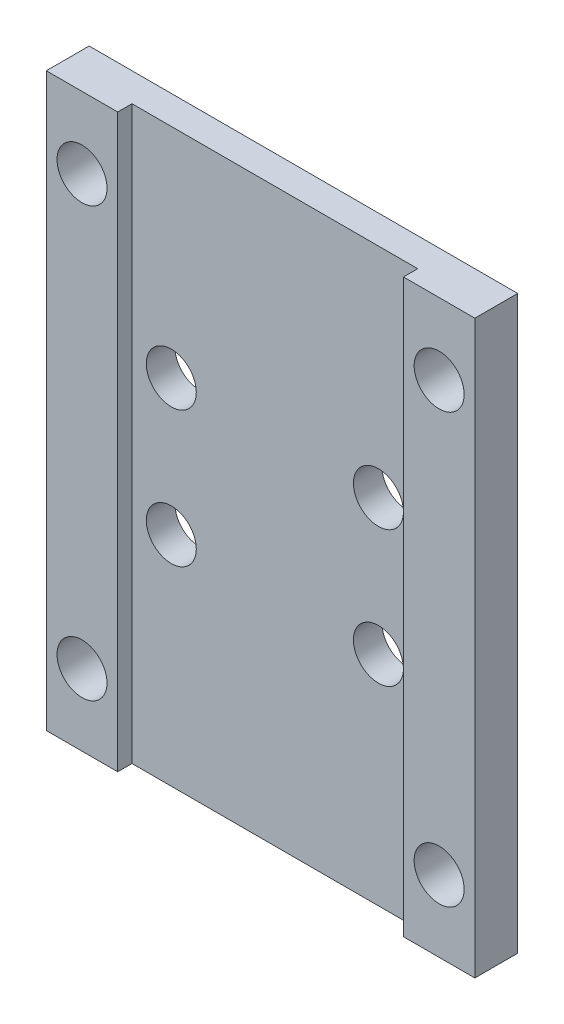
ISO-10303-21;
HEADER;
FILE_DESCRIPTION(('STEP AP214'),'2;1');
FILE_NAME('part.step','',(''),(''),'','','');
FILE_SCHEMA(('AUTOMOTIVE_DESIGN { 1 0 10303 214 1 1 1 1 }'));
ENDSEC;
DATA;
#1=APPLICATION_CONTEXT('core data for automotive mechanical design processes');
#2=APPLICATION_PROTOCOL_DEFINITION('international standard','automotive_design',2000,#1);
#3=PRODUCT_CONTEXT('',#1,'mechanical');
#4=PRODUCT('Part','Part','',(#3));
#5=PRODUCT_RELATED_PRODUCT_CATEGORY('part','',(#4));
#6=PRODUCT_DEFINITION_FORMATION('','',#4);
#7=PRODUCT_DEFINITION_CONTEXT('part definition',#1,'design');
#8=PRODUCT_DEFINITION('design','',#6,#7);
#9=PRODUCT_DEFINITION_SHAPE('','',#8);
#10=(LENGTH_UNIT() NAMED_UNIT(*) SI_UNIT(.MILLI.,.METRE.));
#11=(NAMED_UNIT(*) PLANE_ANGLE_UNIT() SI_UNIT($,.RADIAN.));
#12=(NAMED_UNIT(*) SI_UNIT($,.STERADIAN.) SOLID_ANGLE_UNIT());
#13=UNCERTAINTY_MEASURE_WITH_UNIT(LENGTH_MEASURE(1.E-05),#10,'distance_accuracy_value','');
#14=(GEOMETRIC_REPRESENTATION_CONTEXT(3) GLOBAL_UNCERTAINTY_ASSIGNED_CONTEXT((#13)) GLOBAL_UNIT_ASSIGNED_CONTEXT((#10,
#11,#12)) REPRESENTATION_CONTEXT('',''));
#15=CARTESIAN_POINT('',(0.,0.,0.));
#16=DIRECTION('',(0.,0.,1.));
#17=DIRECTION('',(1.,0.,0.));
#18=AXIS2_PLACEMENT_3D('',#15,#16,#17);
#19=CARTESIAN_POINT('',(0.,0.,0.));
#20=DIRECTION('',(0.,0.,1.));
#21=DIRECTION('',(1.,0.,0.));
#22=AXIS2_PLACEMENT_3D('',#19,#20,#21);
#23=PLANE('',#22);
#24=DIRECTION('',(0.,1.,0.));
#25=VECTOR('',#24,1.);
#26=CARTESIAN_POINT('',(9.99999999999999,0.,0.));
#27=LINE('',#26,#25);
#28=CARTESIAN_POINT('',(9.99999999999999,-20.,0.));
#29=VERTEX_POINT('',#28);
#30=CARTESIAN_POINT('',(9.99999999999999,20.,0.));
#31=VERTEX_POINT('',#30);
#32=EDGE_CURVE('E54',#29,#31,#27,.T.);
#33=ORIENTED_EDGE('',*,*,#32,.T.);
#34=DIRECTION('',(1.,0.,0.));
#35=VECTOR('',#34,1.);
#36=CARTESIAN_POINT('',(0.,20.,0.));
#37=LINE('',#36,#35);
#38=CARTESIAN_POINT('',(-9.99999999999999,20.,0.));
#39=VERTEX_POINT('',#38);
#40=EDGE_CURVE('E197',#39,#31,#37,.T.);
#41=ORIENTED_EDGE('',*,*,#40,.F.);
#42=DIRECTION('',(0.,-1.,0.));
#43=VECTOR('',#42,1.);
#44=CARTESIAN_POINT('',(-9.99999999999999,0.,0.));
#45=LINE('',#44,#43);
#46=CARTESIAN_POINT('',(-9.99999999999999,-20.,0.));
#47=VERTEX_POINT('',#46);
#48=EDGE_CURVE('E111',#39,#47,#45,.T.);
#49=ORIENTED_EDGE('',*,*,#48,.T.);
#50=DIRECTION('',(1.,0.,0.));
#51=VECTOR('',#50,1.);
#52=CARTESIAN_POINT('',(0.,-20.,0.));
#53=LINE('',#52,#51);
#54=EDGE_CURVE('E59',#47,#29,#53,.T.);
#55=ORIENTED_EDGE('',*,*,#54,.T.);
#56=EDGE_LOOP('',(#33,#41,#49,#55));
#57=FACE_BOUND('',#56,.T.);
#58=CARTESIAN_POINT('',(-7.25,4.75,0.));
#59=DIRECTION('',(0.,0.,1.));
#60=DIRECTION('',(1.,0.,0.));
#61=AXIS2_PLACEMENT_3D('',#58,#59,#60);
#62=CIRCLE('',#61,1.75);
#63=CARTESIAN_POINT('',(-5.5,4.75,0.));
#64=VERTEX_POINT('',#63);
#65=EDGE_CURVE('E165',#64,#64,#62,.T.);
#66=ORIENTED_EDGE('',*,*,#65,.F.);
#67=EDGE_LOOP('',(#66));
#68=FACE_BOUND('',#67,.T.);
#69=CARTESIAN_POINT('',(7.25,4.75,0.));
#70=DIRECTION('',(0.,0.,1.));
#71=DIRECTION('',(1.,0.,0.));
#72=AXIS2_PLACEMENT_3D('',#69,#70,#71);
#73=CIRCLE('',#72,1.75);
#74=CARTESIAN_POINT('',(9.,4.75,0.));
#75=VERTEX_POINT('',#74);
#76=EDGE_CURVE('E205',#75,#75,#73,.T.);
#77=ORIENTED_EDGE('',*,*,#76,.F.);
#78=EDGE_LOOP('',(#77));
#79=FACE_BOUND('',#78,.T.);
#80=CARTESIAN_POINT('',(7.25,-4.75,0.));
#81=DIRECTION('',(0.,0.,1.));
#82=DIRECTION('',(1.,0.,0.));
#83=AXIS2_PLACEMENT_3D('',#80,#81,#82);
#84=CIRCLE('',#83,1.75);
#85=CARTESIAN_POINT('',(9.,-4.75,0.));
#86=VERTEX_POINT('',#85);
#87=EDGE_CURVE('E202',#86,#86,#84,.T.);
#88=ORIENTED_EDGE('',*,*,#87,.F.);
#89=EDGE_LOOP('',(#88));
#90=FACE_BOUND('',#89,.T.);
#91=CARTESIAN_POINT('',(-7.25,-4.75,0.));
#92=DIRECTION('',(0.,0.,1.));
#93=DIRECTION('',(1.,0.,0.));
#94=AXIS2_PLACEMENT_3D('',#91,#92,#93);
#95=CIRCLE('',#94,1.75);
#96=CARTESIAN_POINT('',(-5.5,-4.75,0.));
#97=VERTEX_POINT('',#96);
#98=EDGE_CURVE('E199',#97,#97,#95,.T.);
#99=ORIENTED_EDGE('',*,*,#98,.F.);
#100=EDGE_LOOP('',(#99));
#101=FACE_BOUND('',#100,.T.);
#102=ADVANCED_FACE('F37',(#57,#68,#79,#90,#101),#23,.T.);
#103=CARTESIAN_POINT('',(-15.,0.,-2.));
#104=DIRECTION('',(-1.,0.,0.));
#105=DIRECTION('',(0.,-1.,0.));
#106=AXIS2_PLACEMENT_3D('',#103,#104,#105);
#107=PLANE('',#106);
#108=DIRECTION('',(0.,0.,1.));
#109=VECTOR('',#108,1.);
#110=CARTESIAN_POINT('',(-15.,-20.,-2.));
#111=LINE('',#110,#109);
#112=CARTESIAN_POINT('',(-15.,-20.,-2.));
#113=VERTEX_POINT('',#112);
#114=CARTESIAN_POINT('',(-15.,-20.,1.));
#115=VERTEX_POINT('',#114);
#116=EDGE_CURVE('E41',#113,#115,#111,.T.);
#117=ORIENTED_EDGE('',*,*,#116,.T.);
#118=DIRECTION('',(0.,-1.,0.));
#119=VECTOR('',#118,1.);
#120=CARTESIAN_POINT('',(-15.,0.,1.));
#121=LINE('',#120,#119);
#122=CARTESIAN_POINT('',(-15.,20.,1.));
#123=VERTEX_POINT('',#122);
#124=EDGE_CURVE('E145',#123,#115,#121,.T.);
#125=ORIENTED_EDGE('',*,*,#124,.F.);
#126=DIRECTION('',(0.,0.,1.));
#127=VECTOR('',#126,1.);
#128=CARTESIAN_POINT('',(-15.,20.,-2.));
#129=LINE('',#128,#127);
#130=CARTESIAN_POINT('',(-15.,20.,-2.));
#131=VERTEX_POINT('',#130);
#132=EDGE_CURVE('E11',#131,#123,#129,.T.);
#133=ORIENTED_EDGE('',*,*,#132,.F.);
#134=DIRECTION('',(0.,-1.,0.));
#135=VECTOR('',#134,1.);
#136=CARTESIAN_POINT('',(-15.,0.,-2.));
#137=LINE('',#136,#135);
#138=EDGE_CURVE('E168',#131,#113,#137,.T.);
#139=ORIENTED_EDGE('',*,*,#138,.T.);
#140=EDGE_LOOP('',(#117,#125,#133,#139));
#141=FACE_BOUND('',#140,.T.);
#142=ADVANCED_FACE('F213',(#141),#107,.T.);
#143=CARTESIAN_POINT('',(0.,20.,-2.));
#144=DIRECTION('',(0.,-1.,0.));
#145=DIRECTION('',(0.,0.,-1.));
#146=AXIS2_PLACEMENT_3D('',#143,#144,#145);
#147=PLANE('',#146);
#148=ORIENTED_EDGE('',*,*,#132,.T.);
#149=DIRECTION('',(1.,0.,0.));
#150=VECTOR('',#149,1.);
#151=CARTESIAN_POINT('',(0.,20.,1.));
#152=LINE('',#151,#150);
#153=CARTESIAN_POINT('',(-9.99999999999999,20.,1.));
#154=VERTEX_POINT('',#153);
#155=EDGE_CURVE('E153',#123,#154,#152,.T.);
#156=ORIENTED_EDGE('',*,*,#155,.T.);
#157=DIRECTION('',(0.,0.,-1.));
#158=VECTOR('',#157,1.);
#159=CARTESIAN_POINT('',(-9.99999999999999,20.,1.));
#160=LINE('',#159,#158);
#161=EDGE_CURVE('E156',#154,#39,#160,.T.);
#162=ORIENTED_EDGE('',*,*,#161,.T.);
#163=ORIENTED_EDGE('',*,*,#40,.T.);
#164=DIRECTION('',(0.,0.,-1.));
#165=VECTOR('',#164,1.);
#166=CARTESIAN_POINT('',(9.99999999999999,20.,1.));
#167=LINE('',#166,#165);
#168=CARTESIAN_POINT('',(9.99999999999999,20.,1.));
#169=VERTEX_POINT('',#168);
#170=EDGE_CURVE('E112',#169,#31,#167,.T.);
#171=ORIENTED_EDGE('',*,*,#170,.F.);
#172=DIRECTION('',(1.,0.,0.));
#173=VECTOR('',#172,1.);
#174=CARTESIAN_POINT('',(0.,20.,1.));
#175=LINE('',#174,#173);
#176=CARTESIAN_POINT('',(15.,20.,1.));
#177=VERTEX_POINT('',#176);
#178=EDGE_CURVE('E127',#169,#177,#175,.T.);
#179=ORIENTED_EDGE('',*,*,#178,.T.);
#180=DIRECTION('',(0.,0.,1.));
#181=VECTOR('',#180,1.);
#182=CARTESIAN_POINT('',(15.,20.,-2.));
#183=LINE('',#182,#181);
#184=CARTESIAN_POINT('',(15.,20.,-2.));
#185=VERTEX_POINT('',#184);
#186=EDGE_CURVE('E46',#185,#177,#183,.T.);
#187=ORIENTED_EDGE('',*,*,#186,.F.);
#188=DIRECTION('',(1.,0.,0.));
#189=VECTOR('',#188,1.);
#190=CARTESIAN_POINT('',(0.,20.,-2.));
#191=LINE('',#190,#189);
#192=EDGE_CURVE('E175',#131,#185,#191,.T.);
#193=ORIENTED_EDGE('',*,*,#192,.F.);
#194=EDGE_LOOP('',(#148,#156,#162,#163,#171,#179,#187,#193));
#195=FACE_BOUND('',#194,.T.);
#196=ADVANCED_FACE('F222',(#195),#147,.F.);
#197=CARTESIAN_POINT('',(15.,0.,-2.));
#198=DIRECTION('',(-1.,0.,0.));
#199=DIRECTION('',(0.,0.,1.));
#200=AXIS2_PLACEMENT_3D('',#197,#198,#199);
#201=PLANE('',#200);
#202=ORIENTED_EDGE('',*,*,#186,.T.);
#203=DIRECTION('',(0.,-1.,0.));
#204=VECTOR('',#203,1.);
#205=CARTESIAN_POINT('',(15.,0.,1.));
#206=LINE('',#205,#204);
#207=CARTESIAN_POINT('',(15.,-20.,1.));
#208=VERTEX_POINT('',#207);
#209=EDGE_CURVE('E123',#177,#208,#206,.T.);
#210=ORIENTED_EDGE('',*,*,#209,.T.);
#211=DIRECTION('',(0.,0.,1.));
#212=VECTOR('',#211,1.);
#213=CARTESIAN_POINT('',(15.,-20.,-2.));
#214=LINE('',#213,#212);
#215=CARTESIAN_POINT('',(15.,-20.,-2.));
#216=VERTEX_POINT('',#215);
#217=EDGE_CURVE('E119',#216,#208,#214,.T.);
#218=ORIENTED_EDGE('',*,*,#217,.F.);
#219=DIRECTION('',(0.,-1.,0.));
#220=VECTOR('',#219,1.);
#221=CARTESIAN_POINT('',(15.,0.,-2.));
#222=LINE('',#221,#220);
#223=EDGE_CURVE('E173',#185,#216,#222,.T.);
#224=ORIENTED_EDGE('',*,*,#223,.F.);
#225=EDGE_LOOP('',(#202,#210,#218,#224));
#226=FACE_BOUND('',#225,.T.);
#227=ADVANCED_FACE('F230',(#226),#201,.F.);
#228=CARTESIAN_POINT('',(12.5,-15.,-2.));
#229=DIRECTION('',(0.,0.,1.));
#230=DIRECTION('',(1.,0.,0.));
#231=AXIS2_PLACEMENT_3D('',#228,#229,#230);
#232=CYLINDRICAL_SURFACE('',#231,1.75);
#233=CARTESIAN_POINT('',(12.5,-15.,-2.));
#234=DIRECTION('',(0.,0.,1.));
#235=DIRECTION('',(1.,0.,0.));
#236=AXIS2_PLACEMENT_3D('',#233,#234,#235);
#237=CIRCLE('',#236,1.75);
#238=CARTESIAN_POINT('',(14.25,-15.,-2.));
#239=VERTEX_POINT('',#238);
#240=EDGE_CURVE('E190',#239,#239,#237,.T.);
#241=ORIENTED_EDGE('',*,*,#240,.F.);
#242=EDGE_LOOP('',(#241));
#243=FACE_BOUND('',#242,.T.);
#244=CARTESIAN_POINT('',(12.5,-15.,1.));
#245=DIRECTION('',(0.,0.,1.));
#246=DIRECTION('',(1.,0.,0.));
#247=AXIS2_PLACEMENT_3D('',#244,#245,#246);
#248=CIRCLE('',#247,1.75);
#249=CARTESIAN_POINT('',(14.25,-15.,1.));
#250=VERTEX_POINT('',#249);
#251=EDGE_CURVE('E131',#250,#250,#248,.T.);
#252=ORIENTED_EDGE('',*,*,#251,.T.);
#253=EDGE_LOOP('',(#252));
#254=FACE_BOUND('',#253,.T.);
#255=ADVANCED_FACE('F255',(#243,#254),#232,.F.);
#256=CARTESIAN_POINT('',(-7.25,4.75,-2.));
#257=DIRECTION('',(0.,0.,1.));
#258=DIRECTION('',(1.,0.,0.));
#259=AXIS2_PLACEMENT_3D('',#256,#257,#258);
#260=CYLINDRICAL_SURFACE('',#259,1.75);
#261=CARTESIAN_POINT('',(-7.25,4.75,-2.));
#262=DIRECTION('',(0.,0.,1.));
#263=DIRECTION('',(1.,0.,0.));
#264=AXIS2_PLACEMENT_3D('',#261,#262,#263);
#265=CIRCLE('',#264,1.75);
#266=CARTESIAN_POINT('',(-5.5,4.75,-2.));
#267=VERTEX_POINT('',#266);
#268=EDGE_CURVE('E187',#267,#267,#265,.T.);
#269=ORIENTED_EDGE('',*,*,#268,.F.);
#270=EDGE_LOOP('',(#269));
#271=FACE_BOUND('',#270,.T.);
#272=ORIENTED_EDGE('',*,*,#65,.T.);
#273=EDGE_LOOP('',(#272));
#274=FACE_BOUND('',#273,.T.);
#275=ADVANCED_FACE('F258',(#271,#274),#260,.F.);
#276=CARTESIAN_POINT('',(7.25,4.75,-2.));
#277=DIRECTION('',(0.,0.,1.));
#278=DIRECTION('',(1.,0.,0.));
#279=AXIS2_PLACEMENT_3D('',#276,#277,#278);
#280=CYLINDRICAL_SURFACE('',#279,1.75);
#281=CARTESIAN_POINT('',(7.25,4.75,-2.));
#282=DIRECTION('',(0.,0.,1.));
#283=DIRECTION('',(1.,0.,0.));
#284=AXIS2_PLACEMENT_3D('',#281,#282,#283);
#285=CIRCLE('',#284,1.75);
#286=CARTESIAN_POINT('',(9.,4.75,-2.));
#287=VERTEX_POINT('',#286);
#288=EDGE_CURVE('E184',#287,#287,#285,.T.);
#289=ORIENTED_EDGE('',*,*,#288,.F.);
#290=EDGE_LOOP('',(#289));
#291=FACE_BOUND('',#290,.T.);
#292=ORIENTED_EDGE('',*,*,#76,.T.);
#293=EDGE_LOOP('',(#292));
#294=FACE_BOUND('',#293,.T.);
#295=ADVANCED_FACE('F262',(#291,#294),#280,.F.);
#296=CARTESIAN_POINT('',(7.25,-4.75,-2.));
#297=DIRECTION('',(0.,0.,1.));
#298=DIRECTION('',(1.,0.,0.));
#299=AXIS2_PLACEMENT_3D('',#296,#297,#298);
#300=CYLINDRICAL_SURFACE('',#299,1.75);
#301=CARTESIAN_POINT('',(7.25,-4.75,-2.));
#302=DIRECTION('',(0.,0.,1.));
#303=DIRECTION('',(1.,0.,0.));
#304=AXIS2_PLACEMENT_3D('',#301,#302,#303);
#305=CIRCLE('',#304,1.75);
#306=CARTESIAN_POINT('',(9.,-4.75,-2.));
#307=VERTEX_POINT('',#306);
#308=EDGE_CURVE('E181',#307,#307,#305,.T.);
#309=ORIENTED_EDGE('',*,*,#308,.F.);
#310=EDGE_LOOP('',(#309));
#311=FACE_BOUND('',#310,.T.);
#312=ORIENTED_EDGE('',*,*,#87,.T.);
#313=EDGE_LOOP('',(#312));
#314=FACE_BOUND('',#313,.T.);
#315=ADVANCED_FACE('F266',(#311,#314),#300,.F.);
#316=CARTESIAN_POINT('',(-7.25,-4.75,-2.));
#317=DIRECTION('',(0.,0.,1.));
#318=DIRECTION('',(1.,0.,0.));
#319=AXIS2_PLACEMENT_3D('',#316,#317,#318);
#320=CYLINDRICAL_SURFACE('',#319,1.75);
#321=CARTESIAN_POINT('',(-7.25,-4.75,-2.));
#322=DIRECTION('',(0.,0.,1.));
#323=DIRECTION('',(1.,0.,0.));
#324=AXIS2_PLACEMENT_3D('',#321,#322,#323);
#325=CIRCLE('',#324,1.75);
#326=CARTESIAN_POINT('',(-5.5,-4.75,-2.));
#327=VERTEX_POINT('',#326);
#328=EDGE_CURVE('E178',#327,#327,#325,.T.);
#329=ORIENTED_EDGE('',*,*,#328,.F.);
#330=EDGE_LOOP('',(#329));
#331=FACE_BOUND('',#330,.T.);
#332=ORIENTED_EDGE('',*,*,#98,.T.);
#333=EDGE_LOOP('',(#332));
#334=FACE_BOUND('',#333,.T.);
#335=ADVANCED_FACE('F270',(#331,#334),#320,.F.);
#336=CARTESIAN_POINT('',(0.,-20.,-2.));
#337=DIRECTION('',(0.,-1.,0.));
#338=DIRECTION('',(0.,0.,-1.));
#339=AXIS2_PLACEMENT_3D('',#336,#337,#338);
#340=PLANE('',#339);
#341=ORIENTED_EDGE('',*,*,#54,.F.);
#342=DIRECTION('',(0.,0.,-1.));
#343=VECTOR('',#342,1.);
#344=CARTESIAN_POINT('',(-9.99999999999999,-20.,1.));
#345=LINE('',#344,#343);
#346=CARTESIAN_POINT('',(-9.99999999999999,-20.,1.));
#347=VERTEX_POINT('',#346);
#348=EDGE_CURVE('E159',#347,#47,#345,.T.);
#349=ORIENTED_EDGE('',*,*,#348,.F.);
#350=DIRECTION('',(1.,0.,0.));
#351=VECTOR('',#350,1.);
#352=CARTESIAN_POINT('',(0.,-20.,1.));
#353=LINE('',#352,#351);
#354=EDGE_CURVE('E148',#115,#347,#353,.T.);
#355=ORIENTED_EDGE('',*,*,#354,.F.);
#356=ORIENTED_EDGE('',*,*,#116,.F.);
#357=DIRECTION('',(1.,0.,0.));
#358=VECTOR('',#357,1.);
#359=CARTESIAN_POINT('',(0.,-20.,-2.));
#360=LINE('',#359,#358);
#361=EDGE_CURVE('E171',#113,#216,#360,.T.);
#362=ORIENTED_EDGE('',*,*,#361,.T.);
#363=ORIENTED_EDGE('',*,*,#217,.T.);
#364=DIRECTION('',(1.,0.,0.));
#365=VECTOR('',#364,1.);
#366=CARTESIAN_POINT('',(0.,-20.,1.));
#367=LINE('',#366,#365);
#368=CARTESIAN_POINT('',(9.99999999999999,-20.,1.));
#369=VERTEX_POINT('',#368);
#370=EDGE_CURVE('E115',#369,#208,#367,.T.);
#371=ORIENTED_EDGE('',*,*,#370,.F.);
#372=DIRECTION('',(0.,0.,-1.));
#373=VECTOR('',#372,1.);
#374=CARTESIAN_POINT('',(9.99999999999999,-20.,1.));
#375=LINE('',#374,#373);
#376=EDGE_CURVE('E103',#369,#29,#375,.T.);
#377=ORIENTED_EDGE('',*,*,#376,.T.);
#378=EDGE_LOOP('',(#341,#349,#355,#356,#362,#363,#371,#377));
#379=FACE_BOUND('',#378,.T.);
#380=ADVANCED_FACE('F116',(#379),#340,.T.);
#381=CARTESIAN_POINT('',(-12.5,15.,-2.));
#382=DIRECTION('',(0.,0.,1.));
#383=DIRECTION('',(1.,0.,0.));
#384=AXIS2_PLACEMENT_3D('',#381,#382,#383);
#385=CYLINDRICAL_SURFACE('',#384,1.75);
#386=CARTESIAN_POINT('',(-12.5,15.,-2.));
#387=DIRECTION('',(0.,0.,1.));
#388=DIRECTION('',(1.,0.,0.));
#389=AXIS2_PLACEMENT_3D('',#386,#387,#388);
#390=CIRCLE('',#389,1.75);
#391=CARTESIAN_POINT('',(-10.75,15.,-2.));
#392=VERTEX_POINT('',#391);
#393=EDGE_CURVE('E164',#392,#392,#390,.T.);
#394=ORIENTED_EDGE('',*,*,#393,.F.);
#395=EDGE_LOOP('',(#394));
#396=FACE_BOUND('',#395,.T.);
#397=CARTESIAN_POINT('',(-12.5,15.,1.));
#398=DIRECTION('',(0.,0.,1.));
#399=DIRECTION('',(1.,0.,0.));
#400=AXIS2_PLACEMENT_3D('',#397,#398,#399);
#401=CIRCLE('',#400,1.75);
#402=CARTESIAN_POINT('',(-10.75,15.,1.));
#403=VERTEX_POINT('',#402);
#404=EDGE_CURVE('E142',#403,#403,#401,.T.);
#405=ORIENTED_EDGE('',*,*,#404,.T.);
#406=EDGE_LOOP('',(#405));
#407=FACE_BOUND('',#406,.T.);
#408=ADVANCED_FACE('F280',(#396,#407),#385,.F.);
#409=CARTESIAN_POINT('',(-12.5,-15.,-2.));
#410=DIRECTION('',(0.,0.,1.));
#411=DIRECTION('',(1.,0.,0.));
#412=AXIS2_PLACEMENT_3D('',#409,#410,#411);
#413=CYLINDRICAL_SURFACE('',#412,1.75);
#414=CARTESIAN_POINT('',(-12.5,-15.,-2.));
#415=DIRECTION('',(0.,0.,1.));
#416=DIRECTION('',(1.,0.,0.));
#417=AXIS2_PLACEMENT_3D('',#414,#415,#416);
#418=CIRCLE('',#417,1.75);
#419=CARTESIAN_POINT('',(-10.75,-15.,-2.));
#420=VERTEX_POINT('',#419);
#421=EDGE_CURVE('E161',#420,#420,#418,.T.);
#422=ORIENTED_EDGE('',*,*,#421,.F.);
#423=EDGE_LOOP('',(#422));
#424=FACE_BOUND('',#423,.T.);
#425=CARTESIAN_POINT('',(-12.5,-15.,1.));
#426=DIRECTION('',(0.,0.,1.));
#427=DIRECTION('',(1.,0.,0.));
#428=AXIS2_PLACEMENT_3D('',#425,#426,#427);
#429=CIRCLE('',#428,1.75);
#430=CARTESIAN_POINT('',(-10.75,-15.,1.));
#431=VERTEX_POINT('',#430);
#432=EDGE_CURVE('E139',#431,#431,#429,.T.);
#433=ORIENTED_EDGE('',*,*,#432,.T.);
#434=EDGE_LOOP('',(#433));
#435=FACE_BOUND('',#434,.T.);
#436=ADVANCED_FACE('F39',(#424,#435),#413,.F.);
#437=CARTESIAN_POINT('',(12.5,15.,-2.));
#438=DIRECTION('',(0.,0.,1.));
#439=DIRECTION('',(1.,0.,0.));
#440=AXIS2_PLACEMENT_3D('',#437,#438,#439);
#441=CYLINDRICAL_SURFACE('',#440,1.75);
#442=CARTESIAN_POINT('',(12.5,15.,-2.));
#443=DIRECTION('',(0.,0.,1.));
#444=DIRECTION('',(1.,0.,0.));
#445=AXIS2_PLACEMENT_3D('',#442,#443,#444);
#446=CIRCLE('',#445,1.75);
#447=CARTESIAN_POINT('',(14.25,15.,-2.));
#448=VERTEX_POINT('',#447);
#449=EDGE_CURVE('E193',#448,#448,#446,.T.);
#450=ORIENTED_EDGE('',*,*,#449,.F.);
#451=EDGE_LOOP('',(#450));
#452=FACE_BOUND('',#451,.T.);
#453=CARTESIAN_POINT('',(12.5,15.,1.));
#454=DIRECTION('',(0.,0.,1.));
#455=DIRECTION('',(1.,0.,0.));
#456=AXIS2_PLACEMENT_3D('',#453,#454,#455);
#457=CIRCLE('',#456,1.75);
#458=CARTESIAN_POINT('',(14.25,15.,1.));
#459=VERTEX_POINT('',#458);
#460=EDGE_CURVE('E128',#459,#459,#457,.T.);
#461=ORIENTED_EDGE('',*,*,#460,.T.);
#462=EDGE_LOOP('',(#461));
#463=FACE_BOUND('',#462,.T.);
#464=ADVANCED_FACE('F242',(#452,#463),#441,.F.);
#465=CARTESIAN_POINT('',(0.,0.,-2.));
#466=DIRECTION('',(0.,0.,1.));
#467=DIRECTION('',(1.,0.,0.));
#468=AXIS2_PLACEMENT_3D('',#465,#466,#467);
#469=PLANE('',#468);
#470=ORIENTED_EDGE('',*,*,#421,.T.);
#471=EDGE_LOOP('',(#470));
#472=FACE_BOUND('',#471,.T.);
#473=ORIENTED_EDGE('',*,*,#393,.T.);
#474=EDGE_LOOP('',(#473));
#475=FACE_BOUND('',#474,.T.);
#476=ORIENTED_EDGE('',*,*,#138,.F.);
#477=ORIENTED_EDGE('',*,*,#192,.T.);
#478=ORIENTED_EDGE('',*,*,#223,.T.);
#479=ORIENTED_EDGE('',*,*,#361,.F.);
#480=EDGE_LOOP('',(#476,#477,#478,#479));
#481=FACE_BOUND('',#480,.T.);
#482=ORIENTED_EDGE('',*,*,#328,.T.);
#483=EDGE_LOOP('',(#482));
#484=FACE_BOUND('',#483,.T.);
#485=ORIENTED_EDGE('',*,*,#308,.T.);
#486=EDGE_LOOP('',(#485));
#487=FACE_BOUND('',#486,.T.);
#488=ORIENTED_EDGE('',*,*,#288,.T.);
#489=EDGE_LOOP('',(#488));
#490=FACE_BOUND('',#489,.T.);
#491=ORIENTED_EDGE('',*,*,#268,.T.);
#492=EDGE_LOOP('',(#491));
#493=FACE_BOUND('',#492,.T.);
#494=ORIENTED_EDGE('',*,*,#240,.T.);
#495=EDGE_LOOP('',(#494));
#496=FACE_BOUND('',#495,.T.);
#497=ORIENTED_EDGE('',*,*,#449,.T.);
#498=EDGE_LOOP('',(#497));
#499=FACE_BOUND('',#498,.T.);
#500=ADVANCED_FACE('F227',(#472,#475,#481,#484,#487,#490,#493,#496,#499),#469,.F.);
#501=CARTESIAN_POINT('',(-9.99999999999999,0.,1.));
#502=DIRECTION('',(1.,0.,0.));
#503=DIRECTION('',(0.,0.,-1.));
#504=AXIS2_PLACEMENT_3D('',#501,#502,#503);
#505=PLANE('',#504);
#506=ORIENTED_EDGE('',*,*,#48,.F.);
#507=ORIENTED_EDGE('',*,*,#161,.F.);
#508=DIRECTION('',(0.,-1.,0.));
#509=VECTOR('',#508,1.);
#510=CARTESIAN_POINT('',(-9.99999999999999,0.,1.));
#511=LINE('',#510,#509);
#512=EDGE_CURVE('E150',#154,#347,#511,.T.);
#513=ORIENTED_EDGE('',*,*,#512,.T.);
#514=ORIENTED_EDGE('',*,*,#348,.T.);
#515=EDGE_LOOP('',(#506,#507,#513,#514));
#516=FACE_BOUND('',#515,.T.);
#517=ADVANCED_FACE('F233',(#516),#505,.T.);
#518=CARTESIAN_POINT('',(0.,0.,1.));
#519=DIRECTION('',(0.,0.,1.));
#520=DIRECTION('',(1.,0.,0.));
#521=AXIS2_PLACEMENT_3D('',#518,#519,#520);
#522=PLANE('',#521);
#523=ORIENTED_EDGE('',*,*,#432,.F.);
#524=EDGE_LOOP('',(#523));
#525=FACE_BOUND('',#524,.T.);
#526=ORIENTED_EDGE('',*,*,#404,.F.);
#527=EDGE_LOOP('',(#526));
#528=FACE_BOUND('',#527,.T.);
#529=ORIENTED_EDGE('',*,*,#124,.T.);
#530=ORIENTED_EDGE('',*,*,#354,.T.);
#531=ORIENTED_EDGE('',*,*,#512,.F.);
#532=ORIENTED_EDGE('',*,*,#155,.F.);
#533=EDGE_LOOP('',(#529,#530,#531,#532));
#534=FACE_BOUND('',#533,.T.);
#535=ADVANCED_FACE('F220',(#525,#528,#534),#522,.T.);
#536=CARTESIAN_POINT('',(9.99999999999999,0.,1.));
#537=DIRECTION('',(-1.,0.,0.));
#538=DIRECTION('',(0.,0.,1.));
#539=AXIS2_PLACEMENT_3D('',#536,#537,#538);
#540=PLANE('',#539);
#541=ORIENTED_EDGE('',*,*,#32,.F.);
#542=ORIENTED_EDGE('',*,*,#376,.F.);
#543=DIRECTION('',(0.,1.,0.));
#544=VECTOR('',#543,1.);
#545=CARTESIAN_POINT('',(9.99999999999999,0.,1.));
#546=LINE('',#545,#544);
#547=EDGE_CURVE('E108',#369,#169,#546,.T.);
#548=ORIENTED_EDGE('',*,*,#547,.T.);
#549=ORIENTED_EDGE('',*,*,#170,.T.);
#550=EDGE_LOOP('',(#541,#542,#548,#549));
#551=FACE_BOUND('',#550,.T.);
#552=ADVANCED_FACE('F105',(#551),#540,.T.);
#553=CARTESIAN_POINT('',(0.,0.,1.));
#554=DIRECTION('',(0.,0.,1.));
#555=DIRECTION('',(1.,0.,0.));
#556=AXIS2_PLACEMENT_3D('',#553,#554,#555);
#557=PLANE('',#556);
#558=ORIENTED_EDGE('',*,*,#251,.F.);
#559=EDGE_LOOP('',(#558));
#560=FACE_BOUND('',#559,.T.);
#561=ORIENTED_EDGE('',*,*,#460,.F.);
#562=EDGE_LOOP('',(#561));
#563=FACE_BOUND('',#562,.T.);
#564=ORIENTED_EDGE('',*,*,#547,.F.);
#565=ORIENTED_EDGE('',*,*,#370,.T.);
#566=ORIENTED_EDGE('',*,*,#209,.F.);
#567=ORIENTED_EDGE('',*,*,#178,.F.);
#568=EDGE_LOOP('',(#564,#565,#566,#567));
#569=FACE_BOUND('',#568,.T.);
#570=ADVANCED_FACE('F125',(#560,#563,#569),#557,.T.);
#571=CLOSED_SHELL('',(#102,#142,#196,#227,#255,#275,#295,#315,#335,#380,#408,#436,#464,#500,
#517,#535,#552,#570));
#572=MANIFOLD_SOLID_BREP('B2',#571);
#573=ADVANCED_BREP_SHAPE_REPRESENTATION('',(#18,#572),#14);
#574=SHAPE_DEFINITION_REPRESENTATION(#9,#573);
ENDSEC;
END-ISO-10303-21;
